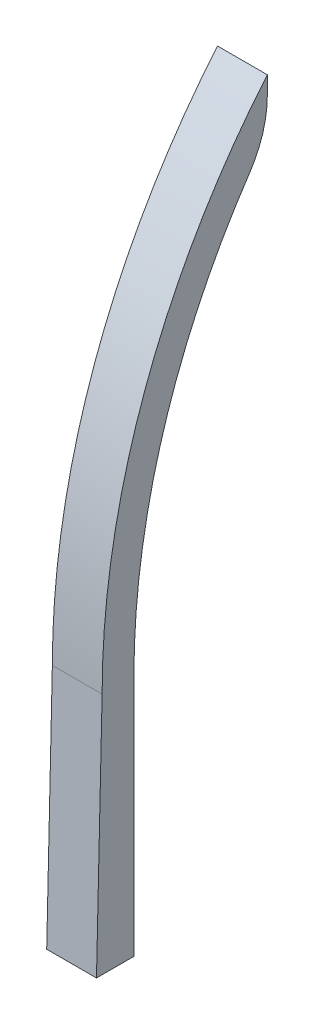
ISO-10303-21;
HEADER;
FILE_DESCRIPTION(('STEP AP214'),'2;1');
FILE_NAME('part.step','',(''),(''),'','','');
FILE_SCHEMA(('AUTOMOTIVE_DESIGN { 1 0 10303 214 1 1 1 1 }'));
ENDSEC;
DATA;
#1=APPLICATION_CONTEXT('core data for automotive mechanical design processes');
#2=APPLICATION_PROTOCOL_DEFINITION('international standard','automotive_design',2000,#1);
#3=PRODUCT_CONTEXT('',#1,'mechanical');
#4=PRODUCT('Part','Part','',(#3));
#5=PRODUCT_RELATED_PRODUCT_CATEGORY('part','',(#4));
#6=PRODUCT_DEFINITION_FORMATION('','',#4);
#7=PRODUCT_DEFINITION_CONTEXT('part definition',#1,'design');
#8=PRODUCT_DEFINITION('design','',#6,#7);
#9=PRODUCT_DEFINITION_SHAPE('','',#8);
#10=(LENGTH_UNIT() NAMED_UNIT(*) SI_UNIT(.MILLI.,.METRE.));
#11=(NAMED_UNIT(*) PLANE_ANGLE_UNIT() SI_UNIT($,.RADIAN.));
#12=(NAMED_UNIT(*) SI_UNIT($,.STERADIAN.) SOLID_ANGLE_UNIT());
#13=UNCERTAINTY_MEASURE_WITH_UNIT(LENGTH_MEASURE(1.E-05),#10,'distance_accuracy_value','');
#14=(GEOMETRIC_REPRESENTATION_CONTEXT(3) GLOBAL_UNCERTAINTY_ASSIGNED_CONTEXT((#13)) GLOBAL_UNIT_ASSIGNED_CONTEXT((#10,
#11,#12)) REPRESENTATION_CONTEXT('',''));
#15=CARTESIAN_POINT('',(0.,0.,0.));
#16=DIRECTION('',(0.,0.,1.));
#17=DIRECTION('',(1.,0.,0.));
#18=AXIS2_PLACEMENT_3D('',#15,#16,#17);
#19=CARTESIAN_POINT('',(2.3876,146.926703399553,-5.84262807197812));
#20=DIRECTION('',(-1.,0.,0.));
#21=DIRECTION('',(0.,0.,1.));
#22=AXIS2_PLACEMENT_3D('',#19,#20,#21);
#23=CYLINDRICAL_SURFACE('',#22,10.);
#24=DIRECTION('',(-1.,0.,0.));
#25=VECTOR('',#24,1.);
#26=CARTESIAN_POINT('',(2.3876,146.926703399553,-15.8426280719781));
#27=LINE('',#26,#25);
#28=CARTESIAN_POINT('',(2.3876,146.926703399553,-15.8426280719781));
#29=VERTEX_POINT('',#28);
#30=CARTESIAN_POINT('',(-2.3876,146.926703399553,-15.8426280719781));
#31=VERTEX_POINT('',#30);
#32=EDGE_CURVE('E123',#29,#31,#27,.T.);
#33=ORIENTED_EDGE('',*,*,#32,.F.);
#34=CARTESIAN_POINT('',(2.3876,146.926703399553,-5.84262807197812));
#35=DIRECTION('',(-1.,0.,0.));
#36=DIRECTION('',(0.,0.,1.));
#37=AXIS2_PLACEMENT_3D('',#34,#35,#36);
#38=CIRCLE('',#37,10.);
#39=CARTESIAN_POINT('',(2.3876,141.328993454883,-14.1291015906315));
#40=VERTEX_POINT('',#39);
#41=EDGE_CURVE('E48',#40,#29,#38,.F.);
#42=ORIENTED_EDGE('',*,*,#41,.F.);
#43=DIRECTION('',(-1.,0.,0.));
#44=VECTOR('',#43,1.);
#45=CARTESIAN_POINT('',(2.3876,141.328993454883,-14.1291015906315));
#46=LINE('',#45,#44);
#47=CARTESIAN_POINT('',(-2.3876,141.328993454883,-14.1291015906315));
#48=VERTEX_POINT('',#47);
#49=EDGE_CURVE('E126',#48,#40,#46,.F.);
#50=ORIENTED_EDGE('',*,*,#49,.F.);
#51=CARTESIAN_POINT('',(-2.3876,146.926703399553,-5.84262807197812));
#52=DIRECTION('',(-1.,0.,0.));
#53=DIRECTION('',(0.,0.,1.));
#54=AXIS2_PLACEMENT_3D('',#51,#52,#53);
#55=CIRCLE('',#54,10.);
#56=EDGE_CURVE('E11',#31,#48,#55,.T.);
#57=ORIENTED_EDGE('',*,*,#56,.F.);
#58=EDGE_LOOP('',(#33,#42,#50,#57));
#59=FACE_BOUND('',#58,.T.);
#60=ADVANCED_FACE('F41',(#59),#23,.T.);
#61=CARTESIAN_POINT('',(2.3876,105.129498876294,-67.7164));
#62=DIRECTION('',(-1.,0.,0.));
#63=DIRECTION('',(0.,0.,1.));
#64=AXIS2_PLACEMENT_3D('',#61,#62,#63);
#65=CYLINDRICAL_SURFACE('',#64,67.7164);
#66=CARTESIAN_POINT('',(-2.3876,105.129498876294,-67.7164));
#67=DIRECTION('',(1.,0.,0.));
#68=DIRECTION('',(0.,0.,1.));
#69=AXIS2_PLACEMENT_3D('',#66,#67,#68);
#70=CIRCLE('',#69,67.7164);
#71=CARTESIAN_POINT('',(-2.3876,148.656761768872,-15.8426280719781));
#72=VERTEX_POINT('',#71);
#73=CARTESIAN_POINT('',(-2.3876,105.129498876294,0.));
#74=VERTEX_POINT('',#73);
#75=EDGE_CURVE('E122',#72,#74,#70,.T.);
#76=ORIENTED_EDGE('',*,*,#75,.T.);
#77=DIRECTION('',(-1.,0.,0.));
#78=VECTOR('',#77,1.);
#79=CARTESIAN_POINT('',(2.3876,105.129498876294,0.));
#80=LINE('',#79,#78);
#81=CARTESIAN_POINT('',(2.3876,105.129498876294,0.));
#82=VERTEX_POINT('',#81);
#83=EDGE_CURVE('E101',#82,#74,#80,.T.);
#84=ORIENTED_EDGE('',*,*,#83,.F.);
#85=CARTESIAN_POINT('',(2.3876,105.129498876294,-67.7164));
#86=DIRECTION('',(1.,0.,0.));
#87=DIRECTION('',(0.,0.,1.));
#88=AXIS2_PLACEMENT_3D('',#85,#86,#87);
#89=CIRCLE('',#88,67.7164);
#90=CARTESIAN_POINT('',(2.3876,148.656761768872,-15.8426280719781));
#91=VERTEX_POINT('',#90);
#92=EDGE_CURVE('E108',#91,#82,#89,.T.);
#93=ORIENTED_EDGE('',*,*,#92,.F.);
#94=DIRECTION('',(-1.,0.,0.));
#95=VECTOR('',#94,1.);
#96=CARTESIAN_POINT('',(2.3876,148.656761768872,-15.8426280719781));
#97=LINE('',#96,#95);
#98=EDGE_CURVE('E136',#91,#72,#97,.T.);
#99=ORIENTED_EDGE('',*,*,#98,.T.);
#100=EDGE_LOOP('',(#76,#84,#93,#99));
#101=FACE_BOUND('',#100,.T.);
#102=ADVANCED_FACE('F120',(#101),#65,.T.);
#103=CARTESIAN_POINT('',(2.3876,81.8206210986452,0.5411957343429));
#104=DIRECTION('',(0.,-0.0232121820822183,-0.999730561002804));
#105=DIRECTION('',(0.,0.999730561002805,-0.0232121820822183));
#106=AXIS2_PLACEMENT_3D('',#103,#104,#105);
#107=PLANE('',#106);
#108=DIRECTION('',(0.,-0.999730561002804,0.0232121820822183));
#109=VECTOR('',#108,1.);
#110=CARTESIAN_POINT('',(-2.3876,81.8206210986452,0.5411957343429));
#111=LINE('',#110,#109);
#112=CARTESIAN_POINT('',(-2.3876,81.8206210986452,0.5411957343429));
#113=VERTEX_POINT('',#112);
#114=EDGE_CURVE('E145',#74,#113,#111,.T.);
#115=ORIENTED_EDGE('',*,*,#114,.T.);
#116=DIRECTION('',(-1.,0.,0.));
#117=VECTOR('',#116,1.);
#118=CARTESIAN_POINT('',(2.3876,81.8206210986452,0.5411957343429));
#119=LINE('',#118,#117);
#120=CARTESIAN_POINT('',(2.3876,81.8206210986452,0.5411957343429));
#121=VERTEX_POINT('',#120);
#122=EDGE_CURVE('E104',#121,#113,#119,.T.);
#123=ORIENTED_EDGE('',*,*,#122,.F.);
#124=DIRECTION('',(0.,-0.999730561002804,0.0232121820822183));
#125=VECTOR('',#124,1.);
#126=CARTESIAN_POINT('',(2.3876,81.8206210986452,0.5411957343429));
#127=LINE('',#126,#125);
#128=EDGE_CURVE('E97',#82,#121,#127,.T.);
#129=ORIENTED_EDGE('',*,*,#128,.F.);
#130=ORIENTED_EDGE('',*,*,#83,.T.);
#131=EDGE_LOOP('',(#115,#123,#129,#130));
#132=FACE_BOUND('',#131,.T.);
#133=ADVANCED_FACE('F99',(#132),#107,.F.);
#134=CARTESIAN_POINT('',(2.3876,81.8206210986452,-3.048));
#135=DIRECTION('',(0.,1.,0.));
#136=DIRECTION('',(0.,0.,1.));
#137=AXIS2_PLACEMENT_3D('',#134,#135,#136);
#138=PLANE('',#137);
#139=DIRECTION('',(0.,0.,-1.));
#140=VECTOR('',#139,1.);
#141=CARTESIAN_POINT('',(-2.3876,81.8206210986452,-3.048));
#142=LINE('',#141,#140);
#143=CARTESIAN_POINT('',(-2.3876,81.8206210986452,-3.048));
#144=VERTEX_POINT('',#143);
#145=EDGE_CURVE('E147',#113,#144,#142,.T.);
#146=ORIENTED_EDGE('',*,*,#145,.T.);
#147=DIRECTION('',(-1.,0.,0.));
#148=VECTOR('',#147,1.);
#149=CARTESIAN_POINT('',(2.3876,81.8206210986452,-3.048));
#150=LINE('',#149,#148);
#151=CARTESIAN_POINT('',(2.3876,81.8206210986452,-3.048));
#152=VERTEX_POINT('',#151);
#153=EDGE_CURVE('E128',#152,#144,#150,.T.);
#154=ORIENTED_EDGE('',*,*,#153,.F.);
#155=DIRECTION('',(0.,0.,-1.));
#156=VECTOR('',#155,1.);
#157=CARTESIAN_POINT('',(2.3876,81.8206210986452,-3.048));
#158=LINE('',#157,#156);
#159=EDGE_CURVE('E107',#121,#152,#158,.T.);
#160=ORIENTED_EDGE('',*,*,#159,.F.);
#161=ORIENTED_EDGE('',*,*,#122,.T.);
#162=EDGE_LOOP('',(#146,#154,#160,#161));
#163=FACE_BOUND('',#162,.T.);
#164=ADVANCED_FACE('F176',(#163),#138,.F.);
#165=CARTESIAN_POINT('',(2.3876,105.129498876294,-3.048));
#166=DIRECTION('',(0.,0.,1.));
#167=DIRECTION('',(1.,0.,0.));
#168=AXIS2_PLACEMENT_3D('',#165,#166,#167);
#169=PLANE('',#168);
#170=DIRECTION('',(0.,1.,0.));
#171=VECTOR('',#170,1.);
#172=CARTESIAN_POINT('',(-2.3876,105.129498876294,-3.048));
#173=LINE('',#172,#171);
#174=CARTESIAN_POINT('',(-2.3876,105.129498876294,-3.048));
#175=VERTEX_POINT('',#174);
#176=EDGE_CURVE('E149',#144,#175,#173,.T.);
#177=ORIENTED_EDGE('',*,*,#176,.T.);
#178=DIRECTION('',(-1.,0.,0.));
#179=VECTOR('',#178,1.);
#180=CARTESIAN_POINT('',(2.3876,105.129498876294,-3.048));
#181=LINE('',#180,#179);
#182=CARTESIAN_POINT('',(2.3876,105.129498876294,-3.048));
#183=VERTEX_POINT('',#182);
#184=EDGE_CURVE('E138',#183,#175,#181,.T.);
#185=ORIENTED_EDGE('',*,*,#184,.F.);
#186=DIRECTION('',(0.,1.,0.));
#187=VECTOR('',#186,1.);
#188=CARTESIAN_POINT('',(2.3876,105.129498876294,-3.048));
#189=LINE('',#188,#187);
#190=EDGE_CURVE('E140',#152,#183,#189,.T.);
#191=ORIENTED_EDGE('',*,*,#190,.F.);
#192=ORIENTED_EDGE('',*,*,#153,.T.);
#193=EDGE_LOOP('',(#177,#185,#191,#192));
#194=FACE_BOUND('',#193,.T.);
#195=ADVANCED_FACE('F161',(#194),#169,.F.);
#196=CARTESIAN_POINT('',(2.3876,105.129498876294,-67.7164));
#197=DIRECTION('',(-1.,0.,0.));
#198=DIRECTION('',(0.,0.,1.));
#199=AXIS2_PLACEMENT_3D('',#196,#197,#198);
#200=CYLINDRICAL_SURFACE('',#199,64.6684);
#201=CARTESIAN_POINT('',(-2.3876,105.129498876294,-67.7164));
#202=DIRECTION('',(-1.,0.,0.));
#203=DIRECTION('',(0.,0.,1.));
#204=AXIS2_PLACEMENT_3D('',#201,#202,#203);
#205=CIRCLE('',#204,64.6684);
#206=EDGE_CURVE('E151',#175,#48,#205,.T.);
#207=ORIENTED_EDGE('',*,*,#206,.T.);
#208=ORIENTED_EDGE('',*,*,#49,.T.);
#209=CARTESIAN_POINT('',(2.3876,105.129498876294,-67.7164));
#210=DIRECTION('',(-1.,0.,0.));
#211=DIRECTION('',(0.,0.,1.));
#212=AXIS2_PLACEMENT_3D('',#209,#210,#211);
#213=CIRCLE('',#212,64.6684);
#214=EDGE_CURVE('E133',#183,#40,#213,.T.);
#215=ORIENTED_EDGE('',*,*,#214,.F.);
#216=ORIENTED_EDGE('',*,*,#184,.T.);
#217=EDGE_LOOP('',(#207,#208,#215,#216));
#218=FACE_BOUND('',#217,.T.);
#219=ADVANCED_FACE('F167',(#218),#200,.F.);
#220=CARTESIAN_POINT('',(2.3876,148.656761768872,-15.8426280719781));
#221=DIRECTION('',(0.,0.,1.));
#222=DIRECTION('',(0.,-1.,0.));
#223=AXIS2_PLACEMENT_3D('',#220,#221,#222);
#224=PLANE('',#223);
#225=DIRECTION('',(0.,1.,0.));
#226=VECTOR('',#225,1.);
#227=CARTESIAN_POINT('',(2.3876,148.656761768872,-15.8426280719781));
#228=LINE('',#227,#226);
#229=EDGE_CURVE('E114',#29,#91,#228,.T.);
#230=ORIENTED_EDGE('',*,*,#229,.F.);
#231=ORIENTED_EDGE('',*,*,#32,.T.);
#232=DIRECTION('',(0.,1.,0.));
#233=VECTOR('',#232,1.);
#234=CARTESIAN_POINT('',(-2.3876,148.656761768872,-15.8426280719781));
#235=LINE('',#234,#233);
#236=EDGE_CURVE('E118',#31,#72,#235,.T.);
#237=ORIENTED_EDGE('',*,*,#236,.T.);
#238=ORIENTED_EDGE('',*,*,#98,.F.);
#239=EDGE_LOOP('',(#230,#231,#237,#238));
#240=FACE_BOUND('',#239,.T.);
#241=ADVANCED_FACE('F135',(#240),#224,.F.);
#242=CARTESIAN_POINT('',(2.3876,105.129498876294,-67.7164));
#243=DIRECTION('',(-1.,0.,0.));
#244=DIRECTION('',(0.,0.,1.));
#245=AXIS2_PLACEMENT_3D('',#242,#243,#244);
#246=PLANE('',#245);
#247=ORIENTED_EDGE('',*,*,#214,.T.);
#248=ORIENTED_EDGE('',*,*,#41,.T.);
#249=ORIENTED_EDGE('',*,*,#229,.T.);
#250=ORIENTED_EDGE('',*,*,#92,.T.);
#251=ORIENTED_EDGE('',*,*,#128,.T.);
#252=ORIENTED_EDGE('',*,*,#159,.T.);
#253=ORIENTED_EDGE('',*,*,#190,.T.);
#254=EDGE_LOOP('',(#247,#248,#249,#250,#251,#252,#253));
#255=FACE_BOUND('',#254,.T.);
#256=ADVANCED_FACE('F112',(#255),#246,.F.);
#257=CARTESIAN_POINT('',(-2.3876,105.129498876294,-67.7164));
#258=DIRECTION('',(-1.,0.,0.));
#259=DIRECTION('',(0.,0.,1.));
#260=AXIS2_PLACEMENT_3D('',#257,#258,#259);
#261=PLANE('',#260);
#262=ORIENTED_EDGE('',*,*,#236,.F.);
#263=ORIENTED_EDGE('',*,*,#56,.T.);
#264=ORIENTED_EDGE('',*,*,#206,.F.);
#265=ORIENTED_EDGE('',*,*,#176,.F.);
#266=ORIENTED_EDGE('',*,*,#145,.F.);
#267=ORIENTED_EDGE('',*,*,#114,.F.);
#268=ORIENTED_EDGE('',*,*,#75,.F.);
#269=EDGE_LOOP('',(#262,#263,#264,#265,#266,#267,#268));
#270=FACE_BOUND('',#269,.T.);
#271=ADVANCED_FACE('F165',(#270),#261,.T.);
#272=CLOSED_SHELL('',(#60,#102,#133,#164,#195,#219,#241,#256,#271));
#273=MANIFOLD_SOLID_BREP('B2',#272);
#274=ADVANCED_BREP_SHAPE_REPRESENTATION('',(#18,#273),#14);
#275=SHAPE_DEFINITION_REPRESENTATION(#9,#274);
ENDSEC;
END-ISO-10303-21;
